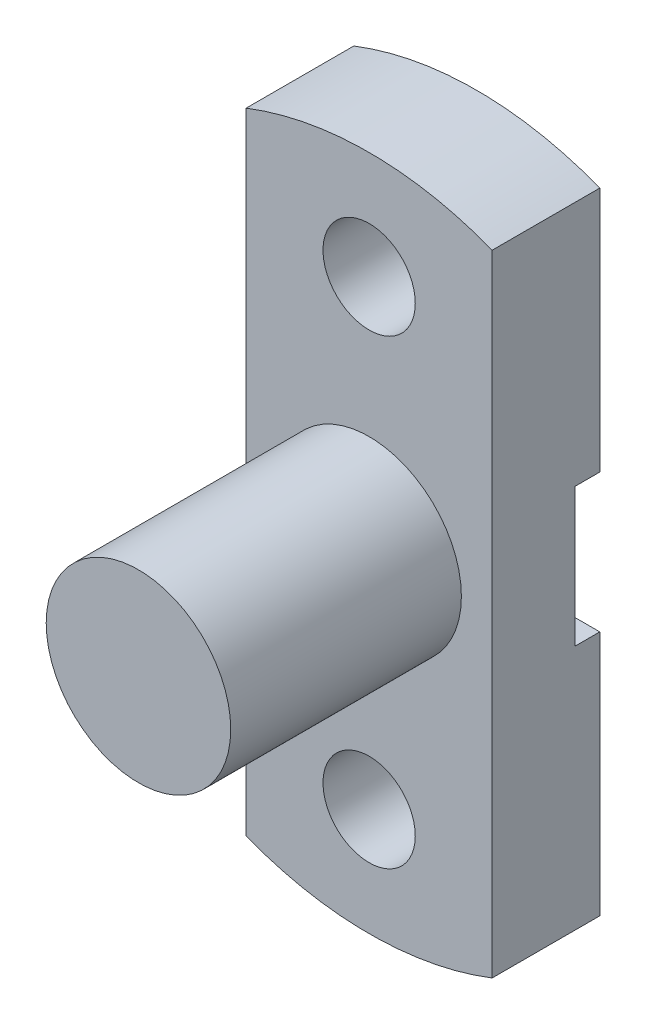
ISO-10303-21;
HEADER;
FILE_DESCRIPTION(('STEP AP214'),'2;1');
FILE_NAME('part.step','',(''),(''),'','','');
FILE_SCHEMA(('AUTOMOTIVE_DESIGN { 1 0 10303 214 1 1 1 1 }'));
ENDSEC;
DATA;
#1=APPLICATION_CONTEXT('core data for automotive mechanical design processes');
#2=APPLICATION_PROTOCOL_DEFINITION('international standard','automotive_design',2000,#1);
#3=PRODUCT_CONTEXT('',#1,'mechanical');
#4=PRODUCT('Part','Part','',(#3));
#5=PRODUCT_RELATED_PRODUCT_CATEGORY('part','',(#4));
#6=PRODUCT_DEFINITION_FORMATION('','',#4);
#7=PRODUCT_DEFINITION_CONTEXT('part definition',#1,'design');
#8=PRODUCT_DEFINITION('design','',#6,#7);
#9=PRODUCT_DEFINITION_SHAPE('','',#8);
#10=(LENGTH_UNIT() NAMED_UNIT(*) SI_UNIT(.MILLI.,.METRE.));
#11=(NAMED_UNIT(*) PLANE_ANGLE_UNIT() SI_UNIT($,.RADIAN.));
#12=(NAMED_UNIT(*) SI_UNIT($,.STERADIAN.) SOLID_ANGLE_UNIT());
#13=UNCERTAINTY_MEASURE_WITH_UNIT(LENGTH_MEASURE(1.E-05),#10,'distance_accuracy_value','');
#14=(GEOMETRIC_REPRESENTATION_CONTEXT(3) GLOBAL_UNCERTAINTY_ASSIGNED_CONTEXT((#13)) GLOBAL_UNIT_ASSIGNED_CONTEXT((#10,
#11,#12)) REPRESENTATION_CONTEXT('',''));
#15=CARTESIAN_POINT('',(0.,0.,0.));
#16=DIRECTION('',(0.,0.,1.));
#17=DIRECTION('',(1.,0.,0.));
#18=AXIS2_PLACEMENT_3D('',#15,#16,#17);
#19=CARTESIAN_POINT('',(-196.926286622666,161.580673550956,0.));
#20=DIRECTION('',(0.,0.,1.));
#21=DIRECTION('',(1.,0.,0.));
#22=AXIS2_PLACEMENT_3D('',#19,#20,#21);
#23=PLANE('',#22);
#24=CARTESIAN_POINT('',(-196.926286622666,86.5806735509555,0.));
#25=DIRECTION('',(0.,0.,1.));
#26=DIRECTION('',(1.,0.,0.));
#27=AXIS2_PLACEMENT_3D('',#24,#25,#26);
#28=CIRCLE('',#27,15.);
#29=CARTESIAN_POINT('',(-181.926286622666,86.5806735509555,0.));
#30=VERTEX_POINT('',#29);
#31=EDGE_CURVE('E141',#30,#30,#28,.T.);
#32=ORIENTED_EDGE('',*,*,#31,.T.);
#33=EDGE_LOOP('',(#32));
#34=FACE_BOUND('',#33,.T.);
#35=DIRECTION('',(0.,-1.,0.));
#36=VECTOR('',#35,1.);
#37=CARTESIAN_POINT('',(-236.926286622666,264.050181210552,0.));
#38=LINE('',#37,#36);
#39=CARTESIAN_POINT('',(-236.926286622666,139.080673550956,0.));
#40=VERTEX_POINT('',#39);
#41=CARTESIAN_POINT('',(-236.926286622666,59.1111658913595,0.));
#42=VERTEX_POINT('',#41);
#43=EDGE_CURVE('E78',#40,#42,#38,.T.);
#44=ORIENTED_EDGE('',*,*,#43,.F.);
#45=DIRECTION('',(1.,0.,0.));
#46=VECTOR('',#45,1.);
#47=CARTESIAN_POINT('',(-196.926286622666,139.080673550956,0.));
#48=LINE('',#47,#46);
#49=CARTESIAN_POINT('',(-156.926286622666,139.080673550956,0.));
#50=VERTEX_POINT('',#49);
#51=EDGE_CURVE('E119',#40,#50,#48,.T.);
#52=ORIENTED_EDGE('',*,*,#51,.T.);
#53=DIRECTION('',(0.,1.,0.));
#54=VECTOR('',#53,1.);
#55=CARTESIAN_POINT('',(-156.926286622666,264.050181210552,0.));
#56=LINE('',#55,#54);
#57=CARTESIAN_POINT('',(-156.926286622666,59.1111658913595,0.));
#58=VERTEX_POINT('',#57);
#59=EDGE_CURVE('E167',#58,#50,#56,.T.);
#60=ORIENTED_EDGE('',*,*,#59,.F.);
#61=CARTESIAN_POINT('',(-196.926286622666,161.580673550956,0.));
#62=DIRECTION('',(0.,0.,1.));
#63=DIRECTION('',(1.,0.,0.));
#64=AXIS2_PLACEMENT_3D('',#61,#62,#63);
#65=CIRCLE('',#64,110.);
#66=EDGE_CURVE('E153',#42,#58,#65,.T.);
#67=ORIENTED_EDGE('',*,*,#66,.F.);
#68=EDGE_LOOP('',(#44,#52,#60,#67));
#69=FACE_BOUND('',#68,.T.);
#70=ADVANCED_FACE('F34',(#34,#69),#23,.F.);
#71=CARTESIAN_POINT('',(-196.926286622666,161.580673550956,35.));
#72=DIRECTION('',(0.,0.,1.));
#73=DIRECTION('',(1.,0.,0.));
#74=AXIS2_PLACEMENT_3D('',#71,#72,#73);
#75=PLANE('',#74);
#76=CARTESIAN_POINT('',(-196.926286622666,161.580673550956,35.));
#77=DIRECTION('',(0.,0.,1.));
#78=DIRECTION('',(1.,0.,0.));
#79=AXIS2_PLACEMENT_3D('',#76,#77,#78);
#80=CIRCLE('',#79,30.);
#81=CARTESIAN_POINT('',(-166.926286622666,161.580673550956,35.));
#82=VERTEX_POINT('',#81);
#83=EDGE_CURVE('E137',#82,#82,#80,.T.);
#84=ORIENTED_EDGE('',*,*,#83,.F.);
#85=EDGE_LOOP('',(#84));
#86=FACE_BOUND('',#85,.T.);
#87=CARTESIAN_POINT('',(-196.926286622666,236.580673550955,35.));
#88=DIRECTION('',(0.,0.,1.));
#89=DIRECTION('',(1.,0.,0.));
#90=AXIS2_PLACEMENT_3D('',#87,#88,#89);
#91=CIRCLE('',#90,15.);
#92=CARTESIAN_POINT('',(-181.926286622666,236.580673550955,35.));
#93=VERTEX_POINT('',#92);
#94=EDGE_CURVE('E150',#93,#93,#91,.T.);
#95=ORIENTED_EDGE('',*,*,#94,.F.);
#96=EDGE_LOOP('',(#95));
#97=FACE_BOUND('',#96,.T.);
#98=CARTESIAN_POINT('',(-196.926286622666,161.580673550956,35.));
#99=DIRECTION('',(0.,0.,1.));
#100=DIRECTION('',(1.,0.,0.));
#101=AXIS2_PLACEMENT_3D('',#98,#99,#100);
#102=CIRCLE('',#101,110.);
#103=CARTESIAN_POINT('',(-236.926286622666,59.1111658913595,35.));
#104=VERTEX_POINT('',#103);
#105=CARTESIAN_POINT('',(-156.926286622666,59.1111658913595,35.));
#106=VERTEX_POINT('',#105);
#107=EDGE_CURVE('E156',#104,#106,#102,.T.);
#108=ORIENTED_EDGE('',*,*,#107,.T.);
#109=DIRECTION('',(0.,1.,0.));
#110=VECTOR('',#109,1.);
#111=CARTESIAN_POINT('',(-156.926286622666,264.050181210552,35.));
#112=LINE('',#111,#110);
#113=CARTESIAN_POINT('',(-156.926286622666,264.050181210552,35.));
#114=VERTEX_POINT('',#113);
#115=EDGE_CURVE('E86',#106,#114,#112,.T.);
#116=ORIENTED_EDGE('',*,*,#115,.T.);
#117=CARTESIAN_POINT('',(-196.926286622666,161.580673550956,35.));
#118=DIRECTION('',(0.,0.,1.));
#119=DIRECTION('',(1.,0.,0.));
#120=AXIS2_PLACEMENT_3D('',#117,#118,#119);
#121=CIRCLE('',#120,110.);
#122=CARTESIAN_POINT('',(-236.926286622666,264.050181210552,35.));
#123=VERTEX_POINT('',#122);
#124=EDGE_CURVE('E160',#114,#123,#121,.T.);
#125=ORIENTED_EDGE('',*,*,#124,.T.);
#126=DIRECTION('',(0.,-1.,0.));
#127=VECTOR('',#126,1.);
#128=CARTESIAN_POINT('',(-236.926286622666,264.050181210552,35.));
#129=LINE('',#128,#127);
#130=EDGE_CURVE('E58',#123,#104,#129,.T.);
#131=ORIENTED_EDGE('',*,*,#130,.T.);
#132=EDGE_LOOP('',(#108,#116,#125,#131));
#133=FACE_BOUND('',#132,.T.);
#134=CARTESIAN_POINT('',(-196.926286622666,86.5806735509555,35.));
#135=DIRECTION('',(0.,0.,1.));
#136=DIRECTION('',(1.,0.,0.));
#137=AXIS2_PLACEMENT_3D('',#134,#135,#136);
#138=CIRCLE('',#137,15.);
#139=CARTESIAN_POINT('',(-181.926286622666,86.5806735509555,35.));
#140=VERTEX_POINT('',#139);
#141=EDGE_CURVE('E144',#140,#140,#138,.T.);
#142=ORIENTED_EDGE('',*,*,#141,.F.);
#143=EDGE_LOOP('',(#142));
#144=FACE_BOUND('',#143,.T.);
#145=ADVANCED_FACE('F186',(#86,#97,#133,#144),#75,.T.);
#146=CARTESIAN_POINT('',(-156.926286622666,184.080673550956,0.));
#147=VERTEX_POINT('',#146);
#148=CARTESIAN_POINT('',(-156.926286622666,264.050181210552,0.));
#149=VERTEX_POINT('',#148);
#150=EDGE_CURVE('E166',#147,#149,#56,.T.);
#151=ORIENTED_EDGE('',*,*,#150,.F.);
#152=DIRECTION('',(-1.,0.,0.));
#153=VECTOR('',#152,1.);
#154=CARTESIAN_POINT('',(-196.926286622666,184.080673550956,0.));
#155=LINE('',#154,#153);
#156=CARTESIAN_POINT('',(-236.926286622666,184.080673550956,0.));
#157=VERTEX_POINT('',#156);
#158=EDGE_CURVE('E130',#147,#157,#155,.T.);
#159=ORIENTED_EDGE('',*,*,#158,.T.);
#160=CARTESIAN_POINT('',(-236.926286622666,264.050181210552,0.));
#161=VERTEX_POINT('',#160);
#162=EDGE_CURVE('E158',#161,#157,#38,.T.);
#163=ORIENTED_EDGE('',*,*,#162,.F.);
#164=CARTESIAN_POINT('',(-196.926286622666,161.580673550956,0.));
#165=DIRECTION('',(0.,0.,1.));
#166=DIRECTION('',(1.,0.,0.));
#167=AXIS2_PLACEMENT_3D('',#164,#165,#166);
#168=CIRCLE('',#167,110.);
#169=EDGE_CURVE('E170',#149,#161,#168,.T.);
#170=ORIENTED_EDGE('',*,*,#169,.F.);
#171=EDGE_LOOP('',(#151,#159,#163,#170));
#172=FACE_BOUND('',#171,.T.);
#173=CARTESIAN_POINT('',(-196.926286622666,236.580673550955,0.));
#174=DIRECTION('',(0.,0.,1.));
#175=DIRECTION('',(1.,0.,0.));
#176=AXIS2_PLACEMENT_3D('',#173,#174,#175);
#177=CIRCLE('',#176,15.);
#178=CARTESIAN_POINT('',(-181.926286622666,236.580673550955,0.));
#179=VERTEX_POINT('',#178);
#180=EDGE_CURVE('E147',#179,#179,#177,.T.);
#181=ORIENTED_EDGE('',*,*,#180,.T.);
#182=EDGE_LOOP('',(#181));
#183=FACE_BOUND('',#182,.T.);
#184=ADVANCED_FACE('F189',(#172,#183),#23,.F.);
#185=CARTESIAN_POINT('',(-196.926286622666,161.580673550956,35.));
#186=DIRECTION('',(0.,0.,-1.));
#187=DIRECTION('',(-1.,0.,0.));
#188=AXIS2_PLACEMENT_3D('',#185,#186,#187);
#189=CYLINDRICAL_SURFACE('',#188,110.);
#190=ORIENTED_EDGE('',*,*,#66,.T.);
#191=DIRECTION('',(0.,0.,-1.));
#192=VECTOR('',#191,1.);
#193=CARTESIAN_POINT('',(-156.926286622666,59.1111658913595,35.));
#194=LINE('',#193,#192);
#195=EDGE_CURVE('E42',#106,#58,#194,.T.);
#196=ORIENTED_EDGE('',*,*,#195,.F.);
#197=ORIENTED_EDGE('',*,*,#107,.F.);
#198=DIRECTION('',(0.,0.,-1.));
#199=VECTOR('',#198,1.);
#200=CARTESIAN_POINT('',(-236.926286622666,59.1111658913595,35.));
#201=LINE('',#200,#199);
#202=EDGE_CURVE('E163',#104,#42,#201,.T.);
#203=ORIENTED_EDGE('',*,*,#202,.T.);
#204=EDGE_LOOP('',(#190,#196,#197,#203));
#205=FACE_BOUND('',#204,.T.);
#206=ADVANCED_FACE('F36',(#205),#189,.T.);
#207=CARTESIAN_POINT('',(-156.926286622666,264.050181210552,35.));
#208=DIRECTION('',(-1.,0.,0.));
#209=DIRECTION('',(0.,0.,1.));
#210=AXIS2_PLACEMENT_3D('',#207,#208,#209);
#211=PLANE('',#210);
#212=ORIENTED_EDGE('',*,*,#59,.T.);
#213=DIRECTION('',(0.,0.,1.));
#214=VECTOR('',#213,1.);
#215=CARTESIAN_POINT('',(-156.926286622666,139.080673550956,35.));
#216=LINE('',#215,#214);
#217=CARTESIAN_POINT('',(-156.926286622666,139.080673550956,8.00000000000002));
#218=VERTEX_POINT('',#217);
#219=EDGE_CURVE('E133',#50,#218,#216,.T.);
#220=ORIENTED_EDGE('',*,*,#219,.T.);
#221=DIRECTION('',(0.,1.,0.));
#222=VECTOR('',#221,1.);
#223=CARTESIAN_POINT('',(-156.926286622666,264.050181210552,7.99999999999999));
#224=LINE('',#223,#222);
#225=CARTESIAN_POINT('',(-156.926286622666,184.080673550956,8.00000000000001));
#226=VERTEX_POINT('',#225);
#227=EDGE_CURVE('E111',#218,#226,#224,.T.);
#228=ORIENTED_EDGE('',*,*,#227,.T.);
#229=DIRECTION('',(0.,0.,-1.));
#230=VECTOR('',#229,1.);
#231=CARTESIAN_POINT('',(-156.926286622666,184.080673550956,35.));
#232=LINE('',#231,#230);
#233=EDGE_CURVE('E114',#226,#147,#232,.T.);
#234=ORIENTED_EDGE('',*,*,#233,.T.);
#235=ORIENTED_EDGE('',*,*,#150,.T.);
#236=DIRECTION('',(0.,0.,-1.));
#237=VECTOR('',#236,1.);
#238=CARTESIAN_POINT('',(-156.926286622666,264.050181210552,35.));
#239=LINE('',#238,#237);
#240=EDGE_CURVE('E177',#114,#149,#239,.T.);
#241=ORIENTED_EDGE('',*,*,#240,.F.);
#242=ORIENTED_EDGE('',*,*,#115,.F.);
#243=ORIENTED_EDGE('',*,*,#195,.T.);
#244=EDGE_LOOP('',(#212,#220,#228,#234,#235,#241,#242,#243));
#245=FACE_BOUND('',#244,.T.);
#246=ADVANCED_FACE('F180',(#245),#211,.F.);
#247=CARTESIAN_POINT('',(-196.926286622666,161.580673550956,35.));
#248=DIRECTION('',(0.,0.,-1.));
#249=DIRECTION('',(-1.,0.,0.));
#250=AXIS2_PLACEMENT_3D('',#247,#248,#249);
#251=CYLINDRICAL_SURFACE('',#250,110.);
#252=ORIENTED_EDGE('',*,*,#169,.T.);
#253=DIRECTION('',(0.,0.,-1.));
#254=VECTOR('',#253,1.);
#255=CARTESIAN_POINT('',(-236.926286622666,264.050181210552,35.));
#256=LINE('',#255,#254);
#257=EDGE_CURVE('E174',#123,#161,#256,.T.);
#258=ORIENTED_EDGE('',*,*,#257,.F.);
#259=ORIENTED_EDGE('',*,*,#124,.F.);
#260=ORIENTED_EDGE('',*,*,#240,.T.);
#261=EDGE_LOOP('',(#252,#258,#259,#260));
#262=FACE_BOUND('',#261,.T.);
#263=ADVANCED_FACE('F218',(#262),#251,.T.);
#264=CARTESIAN_POINT('',(-236.926286622666,264.050181210552,35.));
#265=DIRECTION('',(1.,0.,0.));
#266=DIRECTION('',(0.,0.,-1.));
#267=AXIS2_PLACEMENT_3D('',#264,#265,#266);
#268=PLANE('',#267);
#269=DIRECTION('',(0.,1.,0.));
#270=VECTOR('',#269,1.);
#271=CARTESIAN_POINT('',(-236.926286622666,184.080673550956,8.00000000000001));
#272=LINE('',#271,#270);
#273=CARTESIAN_POINT('',(-236.926286622666,139.080673550956,8.00000000000002));
#274=VERTEX_POINT('',#273);
#275=CARTESIAN_POINT('',(-236.926286622666,184.080673550956,8.00000000000001));
#276=VERTEX_POINT('',#275);
#277=EDGE_CURVE('E49',#274,#276,#272,.T.);
#278=ORIENTED_EDGE('',*,*,#277,.F.);
#279=DIRECTION('',(0.,0.,-1.));
#280=VECTOR('',#279,1.);
#281=CARTESIAN_POINT('',(-236.926286622666,139.080673550956,35.));
#282=LINE('',#281,#280);
#283=EDGE_CURVE('E11',#274,#40,#282,.T.);
#284=ORIENTED_EDGE('',*,*,#283,.T.);
#285=ORIENTED_EDGE('',*,*,#43,.T.);
#286=ORIENTED_EDGE('',*,*,#202,.F.);
#287=ORIENTED_EDGE('',*,*,#130,.F.);
#288=ORIENTED_EDGE('',*,*,#257,.T.);
#289=ORIENTED_EDGE('',*,*,#162,.T.);
#290=DIRECTION('',(0.,0.,-1.));
#291=VECTOR('',#290,1.);
#292=CARTESIAN_POINT('',(-236.926286622666,184.080673550956,-7.99999999999999));
#293=LINE('',#292,#291);
#294=EDGE_CURVE('E123',#276,#157,#293,.T.);
#295=ORIENTED_EDGE('',*,*,#294,.F.);
#296=EDGE_LOOP('',(#278,#284,#285,#286,#287,#288,#289,#295));
#297=FACE_BOUND('',#296,.T.);
#298=ADVANCED_FACE('F121',(#297),#268,.F.);
#299=CARTESIAN_POINT('',(-196.926286622666,236.580673550955,35.));
#300=DIRECTION('',(0.,0.,-1.));
#301=DIRECTION('',(-1.,0.,0.));
#302=AXIS2_PLACEMENT_3D('',#299,#300,#301);
#303=CYLINDRICAL_SURFACE('',#302,15.);
#304=ORIENTED_EDGE('',*,*,#94,.T.);
#305=EDGE_LOOP('',(#304));
#306=FACE_BOUND('',#305,.T.);
#307=ORIENTED_EDGE('',*,*,#180,.F.);
#308=EDGE_LOOP('',(#307));
#309=FACE_BOUND('',#308,.T.);
#310=ADVANCED_FACE('F206',(#306,#309),#303,.F.);
#311=CARTESIAN_POINT('',(-196.926286622666,86.5806735509555,35.));
#312=DIRECTION('',(0.,0.,-1.));
#313=DIRECTION('',(-1.,0.,0.));
#314=AXIS2_PLACEMENT_3D('',#311,#312,#313);
#315=CYLINDRICAL_SURFACE('',#314,15.);
#316=ORIENTED_EDGE('',*,*,#141,.T.);
#317=EDGE_LOOP('',(#316));
#318=FACE_BOUND('',#317,.T.);
#319=ORIENTED_EDGE('',*,*,#31,.F.);
#320=EDGE_LOOP('',(#319));
#321=FACE_BOUND('',#320,.T.);
#322=ADVANCED_FACE('F208',(#318,#321),#315,.F.);
#323=CARTESIAN_POINT('',(-196.926286622666,161.580673550956,110.));
#324=DIRECTION('',(0.,0.,-1.));
#325=DIRECTION('',(-1.,0.,0.));
#326=AXIS2_PLACEMENT_3D('',#323,#324,#325);
#327=CYLINDRICAL_SURFACE('',#326,30.);
#328=CARTESIAN_POINT('',(-196.926286622666,161.580673550956,110.));
#329=DIRECTION('',(0.,0.,1.));
#330=DIRECTION('',(1.,0.,0.));
#331=AXIS2_PLACEMENT_3D('',#328,#329,#330);
#332=CIRCLE('',#331,30.);
#333=CARTESIAN_POINT('',(-166.926286622666,161.580673550956,110.));
#334=VERTEX_POINT('',#333);
#335=EDGE_CURVE('E138',#334,#334,#332,.T.);
#336=ORIENTED_EDGE('',*,*,#335,.F.);
#337=EDGE_LOOP('',(#336));
#338=FACE_BOUND('',#337,.T.);
#339=ORIENTED_EDGE('',*,*,#83,.T.);
#340=EDGE_LOOP('',(#339));
#341=FACE_BOUND('',#340,.T.);
#342=ADVANCED_FACE('F215',(#338,#341),#327,.T.);
#343=CARTESIAN_POINT('',(-196.926286622666,161.580673550956,110.));
#344=DIRECTION('',(0.,0.,1.));
#345=DIRECTION('',(1.,0.,0.));
#346=AXIS2_PLACEMENT_3D('',#343,#344,#345);
#347=PLANE('',#346);
#348=ORIENTED_EDGE('',*,*,#335,.T.);
#349=EDGE_LOOP('',(#348));
#350=FACE_BOUND('',#349,.T.);
#351=ADVANCED_FACE('F222',(#350),#347,.T.);
#352=CARTESIAN_POINT('',(113.073713377334,184.080673550956,8.00000000000001));
#353=DIRECTION('',(0.,0.,1.));
#354=DIRECTION('',(0.,-1.,0.));
#355=AXIS2_PLACEMENT_3D('',#352,#353,#354);
#356=PLANE('',#355);
#357=DIRECTION('',(-1.,0.,0.));
#358=VECTOR('',#357,1.);
#359=CARTESIAN_POINT('',(113.073713377334,139.080673550956,8.00000000000002));
#360=LINE('',#359,#358);
#361=EDGE_CURVE('E107',#218,#274,#360,.T.);
#362=ORIENTED_EDGE('',*,*,#361,.T.);
#363=ORIENTED_EDGE('',*,*,#277,.T.);
#364=DIRECTION('',(-1.,0.,0.));
#365=VECTOR('',#364,1.);
#366=CARTESIAN_POINT('',(113.073713377334,184.080673550956,8.00000000000001));
#367=LINE('',#366,#365);
#368=EDGE_CURVE('E115',#226,#276,#367,.T.);
#369=ORIENTED_EDGE('',*,*,#368,.F.);
#370=ORIENTED_EDGE('',*,*,#227,.F.);
#371=EDGE_LOOP('',(#362,#363,#369,#370));
#372=FACE_BOUND('',#371,.T.);
#373=ADVANCED_FACE('F109',(#372),#356,.F.);
#374=CARTESIAN_POINT('',(113.073713377334,139.080673550956,-7.99999999999999));
#375=DIRECTION('',(0.,-1.,0.));
#376=DIRECTION('',(0.,0.,-1.));
#377=AXIS2_PLACEMENT_3D('',#374,#375,#376);
#378=PLANE('',#377);
#379=ORIENTED_EDGE('',*,*,#283,.F.);
#380=ORIENTED_EDGE('',*,*,#361,.F.);
#381=ORIENTED_EDGE('',*,*,#219,.F.);
#382=ORIENTED_EDGE('',*,*,#51,.F.);
#383=EDGE_LOOP('',(#379,#380,#381,#382));
#384=FACE_BOUND('',#383,.T.);
#385=ADVANCED_FACE('F117',(#384),#378,.F.);
#386=CARTESIAN_POINT('',(113.073713377334,184.080673550956,-7.99999999999999));
#387=DIRECTION('',(0.,1.,0.));
#388=DIRECTION('',(0.,0.,1.));
#389=AXIS2_PLACEMENT_3D('',#386,#387,#388);
#390=PLANE('',#389);
#391=ORIENTED_EDGE('',*,*,#233,.F.);
#392=ORIENTED_EDGE('',*,*,#368,.T.);
#393=ORIENTED_EDGE('',*,*,#294,.T.);
#394=ORIENTED_EDGE('',*,*,#158,.F.);
#395=EDGE_LOOP('',(#391,#392,#393,#394));
#396=FACE_BOUND('',#395,.T.);
#397=ADVANCED_FACE('F229',(#396),#390,.F.);
#398=CLOSED_SHELL('',(#70,#145,#184,#206,#246,#263,#298,#310,#322,#342,#351,#373,#385,#397));
#399=MANIFOLD_SOLID_BREP('B2',#398);
#400=ADVANCED_BREP_SHAPE_REPRESENTATION('',(#18,#399),#14);
#401=SHAPE_DEFINITION_REPRESENTATION(#9,#400);
ENDSEC;
END-ISO-10303-21;
